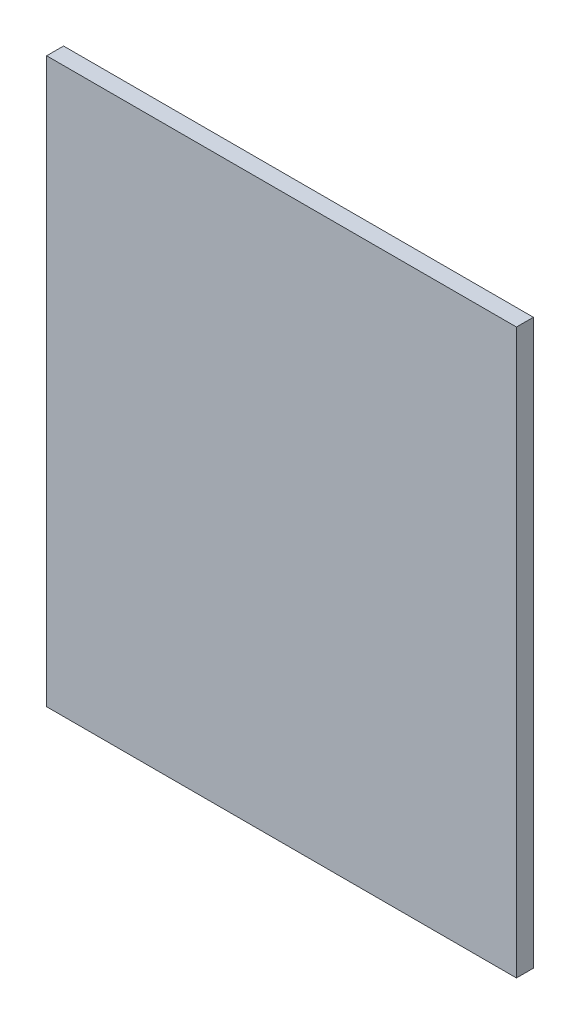
ISO-10303-21;
HEADER;
FILE_DESCRIPTION(('STEP AP214'),'2;1');
FILE_NAME('part.step','',(''),(''),'','','');
FILE_SCHEMA(('AUTOMOTIVE_DESIGN { 1 0 10303 214 1 1 1 1 }'));
ENDSEC;
DATA;
#1=APPLICATION_CONTEXT('core data for automotive mechanical design processes');
#2=APPLICATION_PROTOCOL_DEFINITION('international standard','automotive_design',2000,#1);
#3=PRODUCT_CONTEXT('',#1,'mechanical');
#4=PRODUCT('Part','Part','',(#3));
#5=PRODUCT_RELATED_PRODUCT_CATEGORY('part','',(#4));
#6=PRODUCT_DEFINITION_FORMATION('','',#4);
#7=PRODUCT_DEFINITION_CONTEXT('part definition',#1,'design');
#8=PRODUCT_DEFINITION('design','',#6,#7);
#9=PRODUCT_DEFINITION_SHAPE('','',#8);
#10=(LENGTH_UNIT() NAMED_UNIT(*) SI_UNIT(.MILLI.,.METRE.));
#11=(NAMED_UNIT(*) PLANE_ANGLE_UNIT() SI_UNIT($,.RADIAN.));
#12=(NAMED_UNIT(*) SI_UNIT($,.STERADIAN.) SOLID_ANGLE_UNIT());
#13=UNCERTAINTY_MEASURE_WITH_UNIT(LENGTH_MEASURE(1.E-05),#10,'distance_accuracy_value','');
#14=(GEOMETRIC_REPRESENTATION_CONTEXT(3) GLOBAL_UNCERTAINTY_ASSIGNED_CONTEXT((#13)) GLOBAL_UNIT_ASSIGNED_CONTEXT((#10,
#11,#12)) REPRESENTATION_CONTEXT('',''));
#15=CARTESIAN_POINT('',(0.,0.,0.));
#16=DIRECTION('',(0.,0.,1.));
#17=DIRECTION('',(1.,0.,0.));
#18=AXIS2_PLACEMENT_3D('',#15,#16,#17);
#19=CARTESIAN_POINT('',(-250.,-300.,18.));
#20=DIRECTION('',(1.,0.,0.));
#21=DIRECTION('',(0.,0.,-1.));
#22=AXIS2_PLACEMENT_3D('',#19,#20,#21);
#23=PLANE('',#22);
#24=DIRECTION('',(0.,-1.,0.));
#25=VECTOR('',#24,1.);
#26=CARTESIAN_POINT('',(-250.,-300.,0.));
#27=LINE('',#26,#25);
#28=CARTESIAN_POINT('',(-250.,300.,0.));
#29=VERTEX_POINT('',#28);
#30=CARTESIAN_POINT('',(-250.,-300.,0.));
#31=VERTEX_POINT('',#30);
#32=EDGE_CURVE('E96',#29,#31,#27,.T.);
#33=ORIENTED_EDGE('',*,*,#32,.T.);
#34=DIRECTION('',(0.,0.,-1.));
#35=VECTOR('',#34,1.);
#36=CARTESIAN_POINT('',(-250.,-300.,18.));
#37=LINE('',#36,#35);
#38=CARTESIAN_POINT('',(-250.,-300.,18.));
#39=VERTEX_POINT('',#38);
#40=EDGE_CURVE('E11',#39,#31,#37,.T.);
#41=ORIENTED_EDGE('',*,*,#40,.F.);
#42=DIRECTION('',(0.,-1.,0.));
#43=VECTOR('',#42,1.);
#44=CARTESIAN_POINT('',(-250.,-300.,18.));
#45=LINE('',#44,#43);
#46=CARTESIAN_POINT('',(-250.,300.,18.));
#47=VERTEX_POINT('',#46);
#48=EDGE_CURVE('E84',#47,#39,#45,.T.);
#49=ORIENTED_EDGE('',*,*,#48,.F.);
#50=DIRECTION('',(0.,0.,-1.));
#51=VECTOR('',#50,1.);
#52=CARTESIAN_POINT('',(-250.,300.,18.));
#53=LINE('',#52,#51);
#54=EDGE_CURVE('E92',#47,#29,#53,.T.);
#55=ORIENTED_EDGE('',*,*,#54,.T.);
#56=EDGE_LOOP('',(#33,#41,#49,#55));
#57=FACE_BOUND('',#56,.T.);
#58=ADVANCED_FACE('F33',(#57),#23,.F.);
#59=CARTESIAN_POINT('',(250.,-300.,18.));
#60=DIRECTION('',(0.,1.,0.));
#61=DIRECTION('',(-1.,0.,0.));
#62=AXIS2_PLACEMENT_3D('',#59,#60,#61);
#63=PLANE('',#62);
#64=DIRECTION('',(1.,0.,0.));
#65=VECTOR('',#64,1.);
#66=CARTESIAN_POINT('',(250.,-300.,0.));
#67=LINE('',#66,#65);
#68=CARTESIAN_POINT('',(250.,-300.,0.));
#69=VERTEX_POINT('',#68);
#70=EDGE_CURVE('E88',#31,#69,#67,.T.);
#71=ORIENTED_EDGE('',*,*,#70,.T.);
#72=DIRECTION('',(0.,0.,-1.));
#73=VECTOR('',#72,1.);
#74=CARTESIAN_POINT('',(250.,-300.,18.));
#75=LINE('',#74,#73);
#76=CARTESIAN_POINT('',(250.,-300.,18.));
#77=VERTEX_POINT('',#76);
#78=EDGE_CURVE('E41',#77,#69,#75,.T.);
#79=ORIENTED_EDGE('',*,*,#78,.F.);
#80=DIRECTION('',(1.,0.,0.));
#81=VECTOR('',#80,1.);
#82=CARTESIAN_POINT('',(250.,-300.,18.));
#83=LINE('',#82,#81);
#84=EDGE_CURVE('E79',#39,#77,#83,.T.);
#85=ORIENTED_EDGE('',*,*,#84,.F.);
#86=ORIENTED_EDGE('',*,*,#40,.T.);
#87=EDGE_LOOP('',(#71,#79,#85,#86));
#88=FACE_BOUND('',#87,.T.);
#89=ADVANCED_FACE('F87',(#88),#63,.F.);
#90=CARTESIAN_POINT('',(250.,-300.,18.));
#91=DIRECTION('',(-1.,0.,0.));
#92=DIRECTION('',(0.,0.,1.));
#93=AXIS2_PLACEMENT_3D('',#90,#91,#92);
#94=PLANE('',#93);
#95=DIRECTION('',(0.,1.,0.));
#96=VECTOR('',#95,1.);
#97=CARTESIAN_POINT('',(250.,-300.,0.));
#98=LINE('',#97,#96);
#99=CARTESIAN_POINT('',(250.,300.,0.));
#100=VERTEX_POINT('',#99);
#101=EDGE_CURVE('E66',#69,#100,#98,.T.);
#102=ORIENTED_EDGE('',*,*,#101,.T.);
#103=DIRECTION('',(0.,0.,-1.));
#104=VECTOR('',#103,1.);
#105=CARTESIAN_POINT('',(250.,300.,18.));
#106=LINE('',#105,#104);
#107=CARTESIAN_POINT('',(250.,300.,18.));
#108=VERTEX_POINT('',#107);
#109=EDGE_CURVE('E89',#108,#100,#106,.T.);
#110=ORIENTED_EDGE('',*,*,#109,.F.);
#111=DIRECTION('',(0.,1.,0.));
#112=VECTOR('',#111,1.);
#113=CARTESIAN_POINT('',(250.,-300.,18.));
#114=LINE('',#113,#112);
#115=EDGE_CURVE('E82',#77,#108,#114,.T.);
#116=ORIENTED_EDGE('',*,*,#115,.F.);
#117=ORIENTED_EDGE('',*,*,#78,.T.);
#118=EDGE_LOOP('',(#102,#110,#116,#117));
#119=FACE_BOUND('',#118,.T.);
#120=ADVANCED_FACE('F90',(#119),#94,.F.);
#121=CARTESIAN_POINT('',(250.,300.,18.));
#122=DIRECTION('',(0.,-1.,0.));
#123=DIRECTION('',(1.,0.,0.));
#124=AXIS2_PLACEMENT_3D('',#121,#122,#123);
#125=PLANE('',#124);
#126=DIRECTION('',(-1.,0.,0.));
#127=VECTOR('',#126,1.);
#128=CARTESIAN_POINT('',(250.,300.,0.));
#129=LINE('',#128,#127);
#130=EDGE_CURVE('E72',#100,#29,#129,.T.);
#131=ORIENTED_EDGE('',*,*,#130,.T.);
#132=ORIENTED_EDGE('',*,*,#54,.F.);
#133=DIRECTION('',(-1.,0.,0.));
#134=VECTOR('',#133,1.);
#135=CARTESIAN_POINT('',(250.,300.,18.));
#136=LINE('',#135,#134);
#137=EDGE_CURVE('E49',#108,#47,#136,.T.);
#138=ORIENTED_EDGE('',*,*,#137,.F.);
#139=ORIENTED_EDGE('',*,*,#109,.T.);
#140=EDGE_LOOP('',(#131,#132,#138,#139));
#141=FACE_BOUND('',#140,.T.);
#142=ADVANCED_FACE('F103',(#141),#125,.F.);
#143=CARTESIAN_POINT('',(0.,0.,18.));
#144=DIRECTION('',(0.,0.,1.));
#145=DIRECTION('',(1.,0.,0.));
#146=AXIS2_PLACEMENT_3D('',#143,#144,#145);
#147=PLANE('',#146);
#148=ORIENTED_EDGE('',*,*,#48,.T.);
#149=ORIENTED_EDGE('',*,*,#84,.T.);
#150=ORIENTED_EDGE('',*,*,#115,.T.);
#151=ORIENTED_EDGE('',*,*,#137,.T.);
#152=EDGE_LOOP('',(#148,#149,#150,#151));
#153=FACE_BOUND('',#152,.T.);
#154=ADVANCED_FACE('F80',(#153),#147,.T.);
#155=CARTESIAN_POINT('',(0.,0.,0.));
#156=DIRECTION('',(0.,0.,1.));
#157=DIRECTION('',(1.,0.,0.));
#158=AXIS2_PLACEMENT_3D('',#155,#156,#157);
#159=PLANE('',#158);
#160=ORIENTED_EDGE('',*,*,#32,.F.);
#161=ORIENTED_EDGE('',*,*,#130,.F.);
#162=ORIENTED_EDGE('',*,*,#101,.F.);
#163=ORIENTED_EDGE('',*,*,#70,.F.);
#164=EDGE_LOOP('',(#160,#161,#162,#163));
#165=FACE_BOUND('',#164,.T.);
#166=ADVANCED_FACE('F106',(#165),#159,.F.);
#167=CLOSED_SHELL('',(#58,#89,#120,#142,#154,#166));
#168=MANIFOLD_SOLID_BREP('B2',#167);
#169=ADVANCED_BREP_SHAPE_REPRESENTATION('',(#18,#168),#14);
#170=SHAPE_DEFINITION_REPRESENTATION(#9,#169);
ENDSEC;
END-ISO-10303-21;
